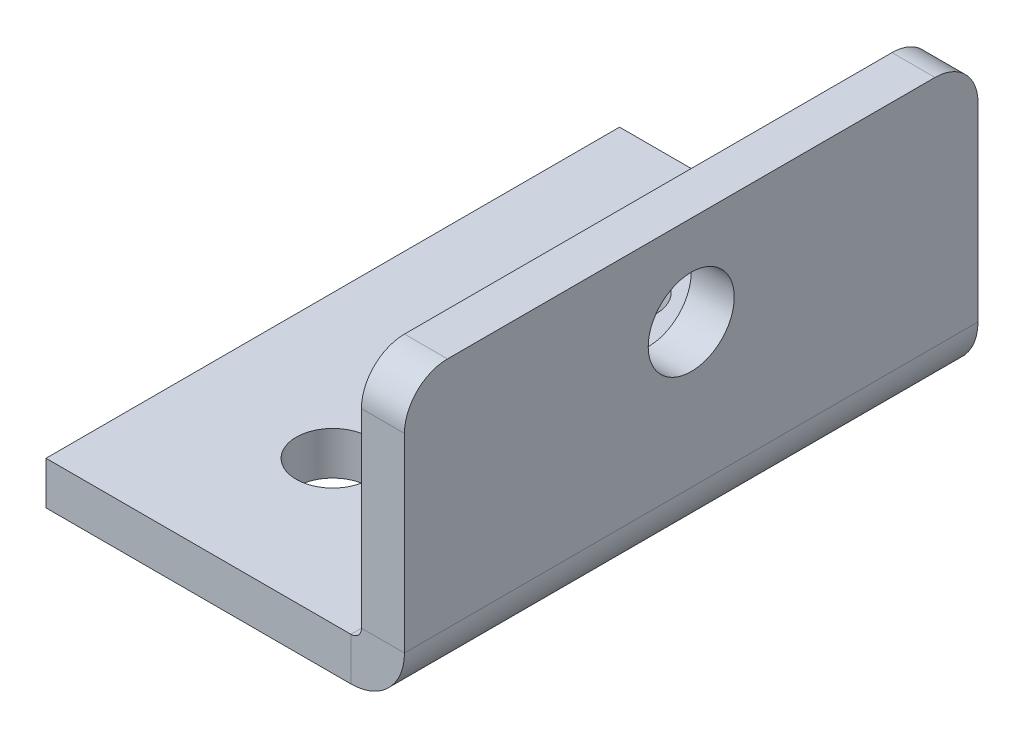
ISO-10303-21;
HEADER;
FILE_DESCRIPTION(('STEP AP214'),'2;1');
FILE_NAME('part.step','',(''),(''),'','','');
FILE_SCHEMA(('AUTOMOTIVE_DESIGN { 1 0 10303 214 1 1 1 1 }'));
ENDSEC;
DATA;
#1=APPLICATION_CONTEXT('core data for automotive mechanical design processes');
#2=APPLICATION_PROTOCOL_DEFINITION('international standard','automotive_design',2000,#1);
#3=PRODUCT_CONTEXT('',#1,'mechanical');
#4=PRODUCT('Part','Part','',(#3));
#5=PRODUCT_RELATED_PRODUCT_CATEGORY('part','',(#4));
#6=PRODUCT_DEFINITION_FORMATION('','',#4);
#7=PRODUCT_DEFINITION_CONTEXT('part definition',#1,'design');
#8=PRODUCT_DEFINITION('design','',#6,#7);
#9=PRODUCT_DEFINITION_SHAPE('','',#8);
#10=(LENGTH_UNIT() NAMED_UNIT(*) SI_UNIT(.MILLI.,.METRE.));
#11=(NAMED_UNIT(*) PLANE_ANGLE_UNIT() SI_UNIT($,.RADIAN.));
#12=(NAMED_UNIT(*) SI_UNIT($,.STERADIAN.) SOLID_ANGLE_UNIT());
#13=UNCERTAINTY_MEASURE_WITH_UNIT(LENGTH_MEASURE(1.E-05),#10,'distance_accuracy_value','');
#14=(GEOMETRIC_REPRESENTATION_CONTEXT(3) GLOBAL_UNCERTAINTY_ASSIGNED_CONTEXT((#13)) GLOBAL_UNIT_ASSIGNED_CONTEXT((#10,
#11,#12)) REPRESENTATION_CONTEXT('',''));
#15=CARTESIAN_POINT('',(0.,0.,0.));
#16=DIRECTION('',(0.,0.,1.));
#17=DIRECTION('',(1.,0.,0.));
#18=AXIS2_PLACEMENT_3D('',#15,#16,#17);
#19=CARTESIAN_POINT('',(-3.7366,0.,40.));
#20=DIRECTION('',(0.,0.,1.));
#21=DIRECTION('',(1.,0.,0.));
#22=AXIS2_PLACEMENT_3D('',#19,#20,#21);
#23=PLANE('',#22);
#24=DIRECTION('',(0.,1.,0.));
#25=VECTOR('',#24,1.);
#26=CARTESIAN_POINT('',(-3.7366,0.,40.));
#27=LINE('',#26,#25);
#28=CARTESIAN_POINT('',(-3.7366,0.,40.));
#29=VERTEX_POINT('',#28);
#30=CARTESIAN_POINT('',(-3.7366,3.,40.));
#31=VERTEX_POINT('',#30);
#32=EDGE_CURVE('E123',#29,#31,#27,.T.);
#33=ORIENTED_EDGE('',*,*,#32,.F.);
#34=CARTESIAN_POINT('',(-3.7366,3.7366,40.));
#35=DIRECTION('',(0.,0.,1.));
#36=DIRECTION('',(1.,0.,0.));
#37=AXIS2_PLACEMENT_3D('',#34,#35,#36);
#38=CIRCLE('',#37,3.7366);
#39=CARTESIAN_POINT('',(0.,3.7366,40.));
#40=VERTEX_POINT('',#39);
#41=EDGE_CURVE('E143',#40,#29,#38,.F.);
#42=ORIENTED_EDGE('',*,*,#41,.F.);
#43=DIRECTION('',(1.,0.,0.));
#44=VECTOR('',#43,1.);
#45=CARTESIAN_POINT('',(-3.,3.7366,40.));
#46=LINE('',#45,#44);
#47=CARTESIAN_POINT('',(-3.,3.7366,40.));
#48=VERTEX_POINT('',#47);
#49=EDGE_CURVE('E191',#48,#40,#46,.T.);
#50=ORIENTED_EDGE('',*,*,#49,.F.);
#51=CARTESIAN_POINT('',(-3.7366,3.7366,40.));
#52=DIRECTION('',(0.,0.,1.));
#53=DIRECTION('',(1.,0.,0.));
#54=AXIS2_PLACEMENT_3D('',#51,#52,#53);
#55=CIRCLE('',#54,0.7366);
#56=EDGE_CURVE('E153',#48,#31,#55,.F.);
#57=ORIENTED_EDGE('',*,*,#56,.T.);
#58=EDGE_LOOP('',(#33,#42,#50,#57));
#59=FACE_BOUND('',#58,.T.);
#60=ADVANCED_FACE('F38',(#59),#23,.T.);
#61=CARTESIAN_POINT('',(-3.,3.7366,40.));
#62=DIRECTION('',(0.,0.,1.));
#63=DIRECTION('',(1.,0.,0.));
#64=AXIS2_PLACEMENT_3D('',#61,#62,#63);
#65=PLANE('',#64);
#66=DIRECTION('',(-1.,0.,0.));
#67=VECTOR('',#66,1.);
#68=CARTESIAN_POINT('',(0.,0.,40.));
#69=LINE('',#68,#67);
#70=CARTESIAN_POINT('',(-25.,0.,40.));
#71=VERTEX_POINT('',#70);
#72=EDGE_CURVE('E141',#29,#71,#69,.T.);
#73=ORIENTED_EDGE('',*,*,#72,.F.);
#74=ORIENTED_EDGE('',*,*,#32,.T.);
#75=DIRECTION('',(-1.,0.,0.));
#76=VECTOR('',#75,1.);
#77=CARTESIAN_POINT('',(0.,3.,40.));
#78=LINE('',#77,#76);
#79=CARTESIAN_POINT('',(-25.,3.,40.));
#80=VERTEX_POINT('',#79);
#81=EDGE_CURVE('E116',#31,#80,#78,.T.);
#82=ORIENTED_EDGE('',*,*,#81,.T.);
#83=DIRECTION('',(0.,1.,0.));
#84=VECTOR('',#83,1.);
#85=CARTESIAN_POINT('',(-25.,0.,40.));
#86=LINE('',#85,#84);
#87=EDGE_CURVE('E121',#71,#80,#86,.T.);
#88=ORIENTED_EDGE('',*,*,#87,.F.);
#89=EDGE_LOOP('',(#73,#74,#82,#88));
#90=FACE_BOUND('',#89,.T.);
#91=ADVANCED_FACE('F119',(#90),#65,.T.);
#92=CARTESIAN_POINT('',(0.,3.7366,0.));
#93=DIRECTION('',(0.,0.,-1.));
#94=DIRECTION('',(-1.,0.,0.));
#95=AXIS2_PLACEMENT_3D('',#92,#93,#94);
#96=PLANE('',#95);
#97=DIRECTION('',(-1.,0.,0.));
#98=VECTOR('',#97,1.);
#99=CARTESIAN_POINT('',(0.,3.7366,0.));
#100=LINE('',#99,#98);
#101=CARTESIAN_POINT('',(0.,3.7366,0.));
#102=VERTEX_POINT('',#101);
#103=CARTESIAN_POINT('',(-3.,3.7366,0.));
#104=VERTEX_POINT('',#103);
#105=EDGE_CURVE('E188',#102,#104,#100,.T.);
#106=ORIENTED_EDGE('',*,*,#105,.F.);
#107=CARTESIAN_POINT('',(-3.7366,3.7366,0.));
#108=DIRECTION('',(0.,0.,1.));
#109=DIRECTION('',(1.,0.,0.));
#110=AXIS2_PLACEMENT_3D('',#107,#108,#109);
#111=CIRCLE('',#110,3.7366);
#112=CARTESIAN_POINT('',(-3.7366,0.,0.));
#113=VERTEX_POINT('',#112);
#114=EDGE_CURVE('E163',#102,#113,#111,.F.);
#115=ORIENTED_EDGE('',*,*,#114,.T.);
#116=DIRECTION('',(0.,-1.,0.));
#117=VECTOR('',#116,1.);
#118=CARTESIAN_POINT('',(-3.7366,3.,0.));
#119=LINE('',#118,#117);
#120=CARTESIAN_POINT('',(-3.7366,3.,0.));
#121=VERTEX_POINT('',#120);
#122=EDGE_CURVE('E137',#121,#113,#119,.T.);
#123=ORIENTED_EDGE('',*,*,#122,.F.);
#124=CARTESIAN_POINT('',(-3.7366,3.7366,0.));
#125=DIRECTION('',(0.,0.,1.));
#126=DIRECTION('',(1.,0.,0.));
#127=AXIS2_PLACEMENT_3D('',#124,#125,#126);
#128=CIRCLE('',#127,0.7366);
#129=EDGE_CURVE('E127',#104,#121,#128,.F.);
#130=ORIENTED_EDGE('',*,*,#129,.F.);
#131=EDGE_LOOP('',(#106,#115,#123,#130));
#132=FACE_BOUND('',#131,.T.);
#133=ADVANCED_FACE('F242',(#132),#96,.T.);
#134=CARTESIAN_POINT('',(-3.7366,3.,0.));
#135=DIRECTION('',(0.,0.,-1.));
#136=DIRECTION('',(-1.,0.,0.));
#137=AXIS2_PLACEMENT_3D('',#134,#135,#136);
#138=PLANE('',#137);
#139=DIRECTION('',(0.,-1.,0.));
#140=VECTOR('',#139,1.);
#141=CARTESIAN_POINT('',(-3.,20.,0.));
#142=LINE('',#141,#140);
#143=CARTESIAN_POINT('',(-3.,17.,0.));
#144=VERTEX_POINT('',#143);
#145=EDGE_CURVE('E168',#144,#104,#142,.T.);
#146=ORIENTED_EDGE('',*,*,#145,.F.);
#147=DIRECTION('',(1.,0.,0.));
#148=VECTOR('',#147,1.);
#149=CARTESIAN_POINT('',(-3.7366,17.,0.));
#150=LINE('',#149,#148);
#151=CARTESIAN_POINT('',(0.,17.,0.));
#152=VERTEX_POINT('',#151);
#153=EDGE_CURVE('E195',#144,#152,#150,.T.);
#154=ORIENTED_EDGE('',*,*,#153,.T.);
#155=DIRECTION('',(0.,-1.,0.));
#156=VECTOR('',#155,1.);
#157=CARTESIAN_POINT('',(0.,20.,0.));
#158=LINE('',#157,#156);
#159=EDGE_CURVE('E166',#152,#102,#158,.T.);
#160=ORIENTED_EDGE('',*,*,#159,.T.);
#161=ORIENTED_EDGE('',*,*,#105,.T.);
#162=EDGE_LOOP('',(#146,#154,#160,#161));
#163=FACE_BOUND('',#162,.T.);
#164=ADVANCED_FACE('F215',(#163),#138,.T.);
#165=CARTESIAN_POINT('',(0.,3.,40.));
#166=DIRECTION('',(0.,-1.,0.));
#167=DIRECTION('',(1.,0.,0.));
#168=AXIS2_PLACEMENT_3D('',#165,#166,#167);
#169=PLANE('',#168);
#170=CARTESIAN_POINT('',(-15.,3.,30.));
#171=DIRECTION('',(0.,1.,0.));
#172=DIRECTION('',(-1.,0.,0.));
#173=AXIS2_PLACEMENT_3D('',#170,#171,#172);
#174=CIRCLE('',#173,2.55);
#175=CARTESIAN_POINT('',(-17.55,3.,30.));
#176=VERTEX_POINT('',#175);
#177=EDGE_CURVE('E290',#176,#176,#174,.T.);
#178=ORIENTED_EDGE('',*,*,#177,.F.);
#179=EDGE_LOOP('',(#178));
#180=FACE_BOUND('',#179,.T.);
#181=CARTESIAN_POINT('',(-15.,3.,10.));
#182=DIRECTION('',(0.,1.,0.));
#183=DIRECTION('',(-1.,0.,0.));
#184=AXIS2_PLACEMENT_3D('',#181,#182,#183);
#185=CIRCLE('',#184,2.55);
#186=CARTESIAN_POINT('',(-17.55,3.,10.));
#187=VERTEX_POINT('',#186);
#188=EDGE_CURVE('E158',#187,#187,#185,.T.);
#189=ORIENTED_EDGE('',*,*,#188,.F.);
#190=EDGE_LOOP('',(#189));
#191=FACE_BOUND('',#190,.T.);
#192=DIRECTION('',(-1.,0.,0.));
#193=VECTOR('',#192,1.);
#194=CARTESIAN_POINT('',(0.,3.,0.));
#195=LINE('',#194,#193);
#196=CARTESIAN_POINT('',(-25.,3.,0.));
#197=VERTEX_POINT('',#196);
#198=EDGE_CURVE('E133',#121,#197,#195,.T.);
#199=ORIENTED_EDGE('',*,*,#198,.T.);
#200=DIRECTION('',(0.,0.,-1.));
#201=VECTOR('',#200,1.);
#202=CARTESIAN_POINT('',(-25.,3.,40.));
#203=LINE('',#202,#201);
#204=EDGE_CURVE('E130',#80,#197,#203,.T.);
#205=ORIENTED_EDGE('',*,*,#204,.F.);
#206=ORIENTED_EDGE('',*,*,#81,.F.);
#207=DIRECTION('',(0.,0.,-1.));
#208=VECTOR('',#207,1.);
#209=CARTESIAN_POINT('',(-3.7366,3.,40.));
#210=LINE('',#209,#208);
#211=EDGE_CURVE('E155',#31,#121,#210,.T.);
#212=ORIENTED_EDGE('',*,*,#211,.T.);
#213=EDGE_LOOP('',(#199,#205,#206,#212));
#214=FACE_BOUND('',#213,.T.);
#215=ADVANCED_FACE('F131',(#180,#191,#214),#169,.F.);
#216=CARTESIAN_POINT('',(-25.,0.,40.));
#217=DIRECTION('',(-1.,0.,0.));
#218=DIRECTION('',(0.,0.,1.));
#219=AXIS2_PLACEMENT_3D('',#216,#217,#218);
#220=PLANE('',#219);
#221=DIRECTION('',(0.,1.,0.));
#222=VECTOR('',#221,1.);
#223=CARTESIAN_POINT('',(-25.,0.,0.));
#224=LINE('',#223,#222);
#225=CARTESIAN_POINT('',(-25.,0.,0.));
#226=VERTEX_POINT('',#225);
#227=EDGE_CURVE('E157',#226,#197,#224,.T.);
#228=ORIENTED_EDGE('',*,*,#227,.F.);
#229=DIRECTION('',(0.,0.,-1.));
#230=VECTOR('',#229,1.);
#231=CARTESIAN_POINT('',(-25.,0.,40.));
#232=LINE('',#231,#230);
#233=EDGE_CURVE('E138',#71,#226,#232,.T.);
#234=ORIENTED_EDGE('',*,*,#233,.F.);
#235=ORIENTED_EDGE('',*,*,#87,.T.);
#236=ORIENTED_EDGE('',*,*,#204,.T.);
#237=EDGE_LOOP('',(#228,#234,#235,#236));
#238=FACE_BOUND('',#237,.T.);
#239=ADVANCED_FACE('F140',(#238),#220,.T.);
#240=CARTESIAN_POINT('',(0.,0.,40.));
#241=DIRECTION('',(0.,-1.,0.));
#242=DIRECTION('',(1.,0.,0.));
#243=AXIS2_PLACEMENT_3D('',#240,#241,#242);
#244=PLANE('',#243);
#245=CARTESIAN_POINT('',(-15.,0.,30.));
#246=DIRECTION('',(0.,-1.,0.));
#247=DIRECTION('',(1.,0.,0.));
#248=AXIS2_PLACEMENT_3D('',#245,#246,#247);
#249=CIRCLE('',#248,2.55);
#250=CARTESIAN_POINT('',(-12.45,0.,30.));
#251=VERTEX_POINT('',#250);
#252=EDGE_CURVE('E287',#251,#251,#249,.F.);
#253=ORIENTED_EDGE('',*,*,#252,.T.);
#254=EDGE_LOOP('',(#253));
#255=FACE_BOUND('',#254,.T.);
#256=CARTESIAN_POINT('',(-15.,0.,10.));
#257=DIRECTION('',(0.,-1.,0.));
#258=DIRECTION('',(1.,0.,0.));
#259=AXIS2_PLACEMENT_3D('',#256,#257,#258);
#260=CIRCLE('',#259,2.55);
#261=CARTESIAN_POINT('',(-12.45,0.,10.));
#262=VERTEX_POINT('',#261);
#263=EDGE_CURVE('E295',#262,#262,#260,.F.);
#264=ORIENTED_EDGE('',*,*,#263,.T.);
#265=EDGE_LOOP('',(#264));
#266=FACE_BOUND('',#265,.T.);
#267=DIRECTION('',(-1.,0.,0.));
#268=VECTOR('',#267,1.);
#269=CARTESIAN_POINT('',(0.,0.,0.));
#270=LINE('',#269,#268);
#271=EDGE_CURVE('E160',#113,#226,#270,.T.);
#272=ORIENTED_EDGE('',*,*,#271,.F.);
#273=DIRECTION('',(0.,0.,-1.));
#274=VECTOR('',#273,1.);
#275=CARTESIAN_POINT('',(-3.7366,0.,40.));
#276=LINE('',#275,#274);
#277=EDGE_CURVE('E183',#29,#113,#276,.T.);
#278=ORIENTED_EDGE('',*,*,#277,.F.);
#279=ORIENTED_EDGE('',*,*,#72,.T.);
#280=ORIENTED_EDGE('',*,*,#233,.T.);
#281=EDGE_LOOP('',(#272,#278,#279,#280));
#282=FACE_BOUND('',#281,.T.);
#283=ADVANCED_FACE('F239',(#255,#266,#282),#244,.T.);
#284=CARTESIAN_POINT('',(-3.7366,3.7366,40.));
#285=DIRECTION('',(0.,0.,-1.));
#286=DIRECTION('',(-1.,0.,0.));
#287=AXIS2_PLACEMENT_3D('',#284,#285,#286);
#288=CYLINDRICAL_SURFACE('',#287,3.7366);
#289=ORIENTED_EDGE('',*,*,#114,.F.);
#290=DIRECTION('',(0.,0.,-1.));
#291=VECTOR('',#290,1.);
#292=CARTESIAN_POINT('',(0.,3.7366,40.));
#293=LINE('',#292,#291);
#294=EDGE_CURVE('E180',#40,#102,#293,.T.);
#295=ORIENTED_EDGE('',*,*,#294,.F.);
#296=ORIENTED_EDGE('',*,*,#41,.T.);
#297=ORIENTED_EDGE('',*,*,#277,.T.);
#298=EDGE_LOOP('',(#289,#295,#296,#297));
#299=FACE_BOUND('',#298,.T.);
#300=ADVANCED_FACE('F233',(#299),#288,.T.);
#301=CARTESIAN_POINT('',(0.,20.,40.));
#302=DIRECTION('',(1.,0.,0.));
#303=DIRECTION('',(0.,1.,0.));
#304=AXIS2_PLACEMENT_3D('',#301,#302,#303);
#305=PLANE('',#304);
#306=CARTESIAN_POINT('',(0.,13.7366,20.));
#307=DIRECTION('',(1.,0.,0.));
#308=DIRECTION('',(0.,1.,0.));
#309=AXIS2_PLACEMENT_3D('',#306,#307,#308);
#310=CIRCLE('',#309,3.);
#311=CARTESIAN_POINT('',(0.,16.7366,20.));
#312=VERTEX_POINT('',#311);
#313=EDGE_CURVE('E282',#312,#312,#310,.F.);
#314=ORIENTED_EDGE('',*,*,#313,.T.);
#315=EDGE_LOOP('',(#314));
#316=FACE_BOUND('',#315,.T.);
#317=ORIENTED_EDGE('',*,*,#159,.F.);
#318=CARTESIAN_POINT('',(0.,17.,3.));
#319=DIRECTION('',(1.,0.,0.));
#320=DIRECTION('',(0.,1.,0.));
#321=AXIS2_PLACEMENT_3D('',#318,#319,#320);
#322=CIRCLE('',#321,3.);
#323=CARTESIAN_POINT('',(0.,20.,3.));
#324=VERTEX_POINT('',#323);
#325=EDGE_CURVE('E200',#152,#324,#322,.T.);
#326=ORIENTED_EDGE('',*,*,#325,.T.);
#327=DIRECTION('',(0.,0.,-1.));
#328=VECTOR('',#327,1.);
#329=CARTESIAN_POINT('',(0.,20.,40.));
#330=LINE('',#329,#328);
#331=CARTESIAN_POINT('',(0.,20.,37.));
#332=VERTEX_POINT('',#331);
#333=EDGE_CURVE('E178',#332,#324,#330,.T.);
#334=ORIENTED_EDGE('',*,*,#333,.F.);
#335=CARTESIAN_POINT('',(0.,17.,37.));
#336=DIRECTION('',(1.,0.,0.));
#337=DIRECTION('',(0.,1.,0.));
#338=AXIS2_PLACEMENT_3D('',#335,#336,#337);
#339=CIRCLE('',#338,3.);
#340=CARTESIAN_POINT('',(0.,17.,40.));
#341=VERTEX_POINT('',#340);
#342=EDGE_CURVE('E198',#332,#341,#339,.T.);
#343=ORIENTED_EDGE('',*,*,#342,.T.);
#344=DIRECTION('',(0.,-1.,0.));
#345=VECTOR('',#344,1.);
#346=CARTESIAN_POINT('',(0.,20.,40.));
#347=LINE('',#346,#345);
#348=EDGE_CURVE('E149',#341,#40,#347,.T.);
#349=ORIENTED_EDGE('',*,*,#348,.T.);
#350=ORIENTED_EDGE('',*,*,#294,.T.);
#351=EDGE_LOOP('',(#317,#326,#334,#343,#349,#350));
#352=FACE_BOUND('',#351,.T.);
#353=ADVANCED_FACE('F221',(#316,#352),#305,.T.);
#354=CARTESIAN_POINT('',(-3.,20.,40.));
#355=DIRECTION('',(0.,1.,0.));
#356=DIRECTION('',(0.,0.,1.));
#357=AXIS2_PLACEMENT_3D('',#354,#355,#356);
#358=PLANE('',#357);
#359=ORIENTED_EDGE('',*,*,#333,.T.);
#360=DIRECTION('',(1.,0.,0.));
#361=VECTOR('',#360,1.);
#362=CARTESIAN_POINT('',(-3.,20.,3.));
#363=LINE('',#362,#361);
#364=CARTESIAN_POINT('',(-3.,20.,3.));
#365=VERTEX_POINT('',#364);
#366=EDGE_CURVE('E59',#324,#365,#363,.F.);
#367=ORIENTED_EDGE('',*,*,#366,.T.);
#368=DIRECTION('',(0.,0.,-1.));
#369=VECTOR('',#368,1.);
#370=CARTESIAN_POINT('',(-3.,20.,40.));
#371=LINE('',#370,#369);
#372=CARTESIAN_POINT('',(-3.,20.,37.));
#373=VERTEX_POINT('',#372);
#374=EDGE_CURVE('E176',#373,#365,#371,.T.);
#375=ORIENTED_EDGE('',*,*,#374,.F.);
#376=DIRECTION('',(1.,0.,0.));
#377=VECTOR('',#376,1.);
#378=CARTESIAN_POINT('',(-3.,20.,37.));
#379=LINE('',#378,#377);
#380=EDGE_CURVE('E202',#373,#332,#379,.T.);
#381=ORIENTED_EDGE('',*,*,#380,.T.);
#382=EDGE_LOOP('',(#359,#367,#375,#381));
#383=FACE_BOUND('',#382,.T.);
#384=ADVANCED_FACE('F222',(#383),#358,.T.);
#385=CARTESIAN_POINT('',(-3.,20.,40.));
#386=DIRECTION('',(1.,0.,0.));
#387=DIRECTION('',(0.,1.,0.));
#388=AXIS2_PLACEMENT_3D('',#385,#386,#387);
#389=PLANE('',#388);
#390=CARTESIAN_POINT('',(-3.,13.7366,20.));
#391=DIRECTION('',(-1.,0.,0.));
#392=DIRECTION('',(0.,0.,1.));
#393=AXIS2_PLACEMENT_3D('',#390,#391,#392);
#394=CIRCLE('',#393,3.);
#395=CARTESIAN_POINT('',(-3.,13.7366,23.));
#396=VERTEX_POINT('',#395);
#397=EDGE_CURVE('E285',#396,#396,#394,.T.);
#398=ORIENTED_EDGE('',*,*,#397,.F.);
#399=EDGE_LOOP('',(#398));
#400=FACE_BOUND('',#399,.T.);
#401=ORIENTED_EDGE('',*,*,#374,.T.);
#402=CARTESIAN_POINT('',(-3.,17.,3.));
#403=DIRECTION('',(1.,0.,0.));
#404=DIRECTION('',(0.,1.,0.));
#405=AXIS2_PLACEMENT_3D('',#402,#403,#404);
#406=CIRCLE('',#405,3.);
#407=EDGE_CURVE('E46',#365,#144,#406,.F.);
#408=ORIENTED_EDGE('',*,*,#407,.T.);
#409=ORIENTED_EDGE('',*,*,#145,.T.);
#410=DIRECTION('',(0.,0.,-1.));
#411=VECTOR('',#410,1.);
#412=CARTESIAN_POINT('',(-3.,3.7366,40.));
#413=LINE('',#412,#411);
#414=EDGE_CURVE('E173',#48,#104,#413,.T.);
#415=ORIENTED_EDGE('',*,*,#414,.F.);
#416=DIRECTION('',(0.,-1.,0.));
#417=VECTOR('',#416,1.);
#418=CARTESIAN_POINT('',(-3.,20.,40.));
#419=LINE('',#418,#417);
#420=CARTESIAN_POINT('',(-3.,17.,40.));
#421=VERTEX_POINT('',#420);
#422=EDGE_CURVE('E151',#421,#48,#419,.T.);
#423=ORIENTED_EDGE('',*,*,#422,.F.);
#424=CARTESIAN_POINT('',(-3.,17.,37.));
#425=DIRECTION('',(1.,0.,0.));
#426=DIRECTION('',(0.,1.,0.));
#427=AXIS2_PLACEMENT_3D('',#424,#425,#426);
#428=CIRCLE('',#427,3.);
#429=EDGE_CURVE('E206',#421,#373,#428,.F.);
#430=ORIENTED_EDGE('',*,*,#429,.T.);
#431=EDGE_LOOP('',(#401,#408,#409,#415,#423,#430));
#432=FACE_BOUND('',#431,.T.);
#433=ADVANCED_FACE('F210',(#400,#432),#389,.F.);
#434=CARTESIAN_POINT('',(-3.7366,3.7366,40.));
#435=DIRECTION('',(0.,0.,-1.));
#436=DIRECTION('',(-1.,0.,0.));
#437=AXIS2_PLACEMENT_3D('',#434,#435,#436);
#438=CYLINDRICAL_SURFACE('',#437,0.7366);
#439=ORIENTED_EDGE('',*,*,#129,.T.);
#440=ORIENTED_EDGE('',*,*,#211,.F.);
#441=ORIENTED_EDGE('',*,*,#56,.F.);
#442=ORIENTED_EDGE('',*,*,#414,.T.);
#443=EDGE_LOOP('',(#439,#440,#441,#442));
#444=FACE_BOUND('',#443,.T.);
#445=ADVANCED_FACE('F245',(#444),#438,.F.);
#446=CARTESIAN_POINT('',(-3.7366,3.7366,40.));
#447=DIRECTION('',(0.,0.,1.));
#448=DIRECTION('',(1.,0.,0.));
#449=AXIS2_PLACEMENT_3D('',#446,#447,#448);
#450=PLANE('',#449);
#451=ORIENTED_EDGE('',*,*,#348,.F.);
#452=DIRECTION('',(1.,0.,0.));
#453=VECTOR('',#452,1.);
#454=CARTESIAN_POINT('',(-3.7366,17.,40.));
#455=LINE('',#454,#453);
#456=EDGE_CURVE('E11',#341,#421,#455,.F.);
#457=ORIENTED_EDGE('',*,*,#456,.T.);
#458=ORIENTED_EDGE('',*,*,#422,.T.);
#459=ORIENTED_EDGE('',*,*,#49,.T.);
#460=EDGE_LOOP('',(#451,#457,#458,#459));
#461=FACE_BOUND('',#460,.T.);
#462=ADVANCED_FACE('F226',(#461),#450,.T.);
#463=CARTESIAN_POINT('',(-3.7366,3.7366,0.));
#464=DIRECTION('',(0.,0.,1.));
#465=DIRECTION('',(1.,0.,0.));
#466=AXIS2_PLACEMENT_3D('',#463,#464,#465);
#467=PLANE('',#466);
#468=ORIENTED_EDGE('',*,*,#198,.F.);
#469=ORIENTED_EDGE('',*,*,#122,.T.);
#470=ORIENTED_EDGE('',*,*,#271,.T.);
#471=ORIENTED_EDGE('',*,*,#227,.T.);
#472=EDGE_LOOP('',(#468,#469,#470,#471));
#473=FACE_BOUND('',#472,.T.);
#474=ADVANCED_FACE('F246',(#473),#467,.F.);
#475=CARTESIAN_POINT('',(-15.,-0.0010000000000049,10.));
#476=DIRECTION('',(0.,1.,0.));
#477=DIRECTION('',(-1.,0.,0.));
#478=AXIS2_PLACEMENT_3D('',#475,#476,#477);
#479=CYLINDRICAL_SURFACE('',#478,2.55);
#480=ORIENTED_EDGE('',*,*,#263,.F.);
#481=EDGE_LOOP('',(#480));
#482=FACE_BOUND('',#481,.T.);
#483=ORIENTED_EDGE('',*,*,#188,.T.);
#484=EDGE_LOOP('',(#483));
#485=FACE_BOUND('',#484,.T.);
#486=ADVANCED_FACE('F248',(#482,#485),#479,.F.);
#487=CARTESIAN_POINT('',(-15.,-0.0010000000000049,30.));
#488=DIRECTION('',(0.,1.,0.));
#489=DIRECTION('',(-1.,0.,0.));
#490=AXIS2_PLACEMENT_3D('',#487,#488,#489);
#491=CYLINDRICAL_SURFACE('',#490,2.55);
#492=ORIENTED_EDGE('',*,*,#252,.F.);
#493=EDGE_LOOP('',(#492));
#494=FACE_BOUND('',#493,.T.);
#495=ORIENTED_EDGE('',*,*,#177,.T.);
#496=EDGE_LOOP('',(#495));
#497=FACE_BOUND('',#496,.T.);
#498=ADVANCED_FACE('F254',(#494,#497),#491,.F.);
#499=CARTESIAN_POINT('',(0.0010000000000023,13.7366,20.));
#500=DIRECTION('',(-1.,0.,0.));
#501=DIRECTION('',(0.,0.,1.));
#502=AXIS2_PLACEMENT_3D('',#499,#500,#501);
#503=CYLINDRICAL_SURFACE('',#502,3.);
#504=ORIENTED_EDGE('',*,*,#313,.F.);
#505=EDGE_LOOP('',(#504));
#506=FACE_BOUND('',#505,.T.);
#507=ORIENTED_EDGE('',*,*,#397,.T.);
#508=EDGE_LOOP('',(#507));
#509=FACE_BOUND('',#508,.T.);
#510=ADVANCED_FACE('F267',(#506,#509),#503,.F.);
#511=CARTESIAN_POINT('',(-3.7366,17.,3.));
#512=DIRECTION('',(1.,0.,0.));
#513=DIRECTION('',(0.,0.,-1.));
#514=AXIS2_PLACEMENT_3D('',#511,#512,#513);
#515=CYLINDRICAL_SURFACE('',#514,3.);
#516=ORIENTED_EDGE('',*,*,#407,.F.);
#517=ORIENTED_EDGE('',*,*,#366,.F.);
#518=ORIENTED_EDGE('',*,*,#325,.F.);
#519=ORIENTED_EDGE('',*,*,#153,.F.);
#520=EDGE_LOOP('',(#516,#517,#518,#519));
#521=FACE_BOUND('',#520,.T.);
#522=ADVANCED_FACE('F218',(#521),#515,.T.);
#523=CARTESIAN_POINT('',(-3.,17.,37.));
#524=DIRECTION('',(1.,0.,0.));
#525=DIRECTION('',(0.,0.,-1.));
#526=AXIS2_PLACEMENT_3D('',#523,#524,#525);
#527=CYLINDRICAL_SURFACE('',#526,3.);
#528=ORIENTED_EDGE('',*,*,#429,.F.);
#529=ORIENTED_EDGE('',*,*,#456,.F.);
#530=ORIENTED_EDGE('',*,*,#342,.F.);
#531=ORIENTED_EDGE('',*,*,#380,.F.);
#532=EDGE_LOOP('',(#528,#529,#530,#531));
#533=FACE_BOUND('',#532,.T.);
#534=ADVANCED_FACE('F40',(#533),#527,.T.);
#535=CLOSED_SHELL('',(#60,#91,#133,#164,#215,#239,#283,#300,#353,#384,#433,#445,#462,#474,#486,
#498,#510,#522,#534));
#536=MANIFOLD_SOLID_BREP('B2',#535);
#537=ADVANCED_BREP_SHAPE_REPRESENTATION('',(#18,#536),#14);
#538=SHAPE_DEFINITION_REPRESENTATION(#9,#537);
ENDSEC;
END-ISO-10303-21;
